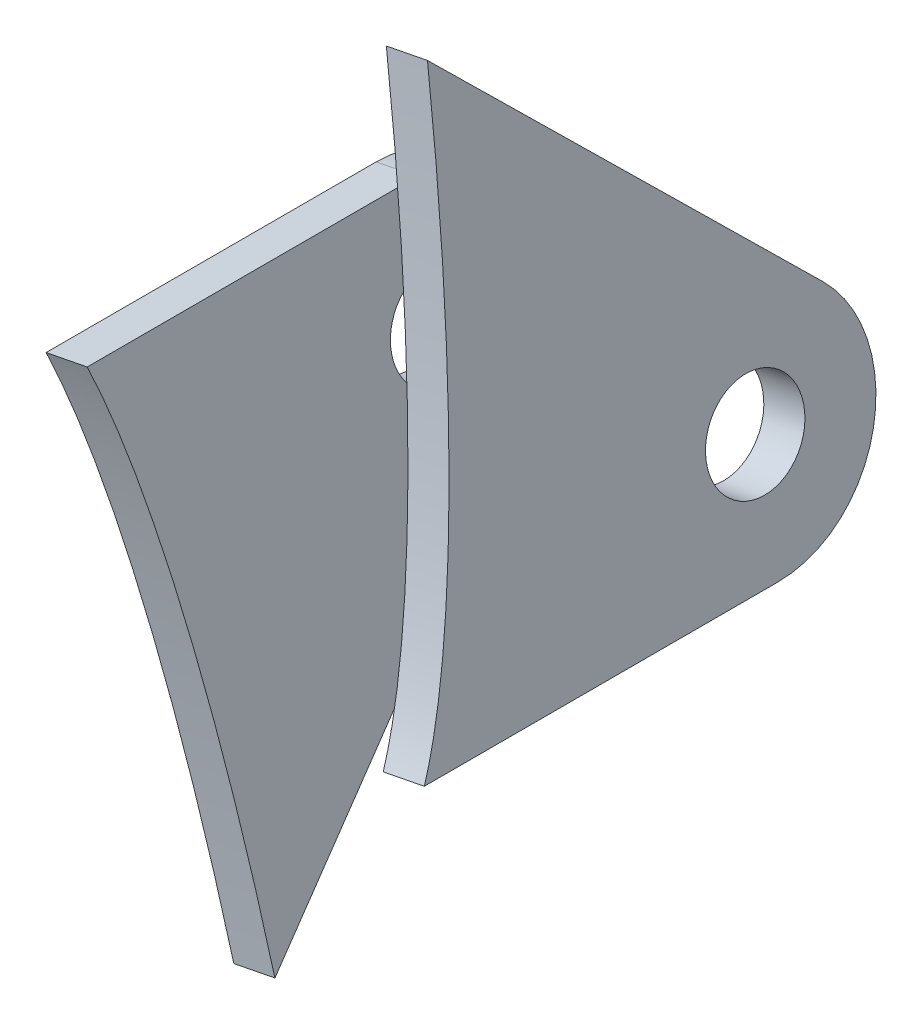
ISO-10303-21;
HEADER;
FILE_DESCRIPTION(('STEP AP214'),'2;1');
FILE_NAME('part.step','',(''),(''),'','','');
FILE_SCHEMA(('AUTOMOTIVE_DESIGN { 1 0 10303 214 1 1 1 1 }'));
ENDSEC;
DATA;
#1=APPLICATION_CONTEXT('core data for automotive mechanical design processes');
#2=APPLICATION_PROTOCOL_DEFINITION('international standard','automotive_design',2000,#1);
#3=PRODUCT_CONTEXT('',#1,'mechanical');
#4=PRODUCT('Part','Part','',(#3));
#5=PRODUCT_RELATED_PRODUCT_CATEGORY('part','',(#4));
#6=PRODUCT_DEFINITION_FORMATION('','',#4);
#7=PRODUCT_DEFINITION_CONTEXT('part definition',#1,'design');
#8=PRODUCT_DEFINITION('design','',#6,#7);
#9=PRODUCT_DEFINITION_SHAPE('','',#8);
#10=(LENGTH_UNIT() NAMED_UNIT(*) SI_UNIT(.MILLI.,.METRE.));
#11=(NAMED_UNIT(*) PLANE_ANGLE_UNIT() SI_UNIT($,.RADIAN.));
#12=(NAMED_UNIT(*) SI_UNIT($,.STERADIAN.) SOLID_ANGLE_UNIT());
#13=UNCERTAINTY_MEASURE_WITH_UNIT(LENGTH_MEASURE(1.E-05),#10,'distance_accuracy_value','');
#14=(GEOMETRIC_REPRESENTATION_CONTEXT(3) GLOBAL_UNCERTAINTY_ASSIGNED_CONTEXT((#13)) GLOBAL_UNIT_ASSIGNED_CONTEXT((#10,
#11,#12)) REPRESENTATION_CONTEXT('',''));
#15=CARTESIAN_POINT('',(0.,0.,0.));
#16=DIRECTION('',(0.,0.,1.));
#17=DIRECTION('',(1.,0.,0.));
#18=AXIS2_PLACEMENT_3D('',#15,#16,#17);
#19=CARTESIAN_POINT('',(1355.52524435521,308.134258911393,-42.2393244097412));
#20=DIRECTION('',(-0.136168267482673,0.693871930706592,-0.707106743503605));
#21=DIRECTION('',(0.,-0.713754853495984,-0.700395609003174));
#22=AXIS2_PLACEMENT_3D('',#19,#20,#21);
#23=PLANE('',#22);
#24=DIRECTION('',(-0.135715180098198,0.693960692822463,0.70710674350361));
#25=VECTOR('',#24,1.);
#26=CARTESIAN_POINT('',(1352.58120693435,307.557507053698,-42.2383449961358));
#27=LINE('',#26,#25);
#28=CARTESIAN_POINT('',(1429.01110735333,-83.256155859534,-440.45539007882));
#29=VERTEX_POINT('',#28);
#30=CARTESIAN_POINT('',(1424.44822645302,-59.9244991608975,-416.681749929812));
#31=VERTEX_POINT('',#30);
#32=EDGE_CURVE('E120',#29,#31,#27,.T.);
#33=ORIENTED_EDGE('',*,*,#32,.T.);
#34=DIRECTION('',(-0.9813458069517,-0.192250619231438,0.000326471201787507));
#35=VECTOR('',#34,1.);
#36=CARTESIAN_POINT('',(1427.39226387388,-59.3477473032032,-416.682729343418));
#37=LINE('',#36,#35);
#38=CARTESIAN_POINT('',(1427.39226387388,-59.3477473032032,-416.682729343418));
#39=VERTEX_POINT('',#38);
#40=EDGE_CURVE('E53',#39,#31,#37,.T.);
#41=ORIENTED_EDGE('',*,*,#40,.F.);
#42=DIRECTION('',(-0.135715180098198,0.693960692822463,0.70710674350361));
#43=VECTOR('',#42,1.);
#44=CARTESIAN_POINT('',(1355.52524435521,308.134258911393,-42.2393244097412));
#45=LINE('',#44,#43);
#46=CARTESIAN_POINT('',(1431.95514477419,-82.6794040018397,-440.456369492425));
#47=VERTEX_POINT('',#46);
#48=EDGE_CURVE('E103',#47,#39,#45,.T.);
#49=ORIENTED_EDGE('',*,*,#48,.F.);
#50=DIRECTION('',(-0.9813458069517,-0.192250619231438,0.000326471201787507));
#51=VECTOR('',#50,1.);
#52=CARTESIAN_POINT('',(1431.95514477419,-82.6794040018397,-440.456369492425));
#53=LINE('',#52,#51);
#54=EDGE_CURVE('E12',#47,#29,#53,.T.);
#55=ORIENTED_EDGE('',*,*,#54,.T.);
#56=EDGE_LOOP('',(#33,#41,#49,#55));
#57=FACE_BOUND('',#56,.T.);
#58=ADVANCED_FACE('F49',(#57),#23,.T.);
#59=CARTESIAN_POINT('',(1433.11257504779,-88.5773154128458,-434.445962172645));
#60=DIRECTION('',(-0.9813458069517,-0.192250619231438,0.000326471201787507));
#61=DIRECTION('',(0.192250629476805,-0.981345859249313,0.));
#62=AXIS2_PLACEMENT_3D('',#59,#60,#61);
#63=CYLINDRICAL_SURFACE('',#62,8.50000000000002);
#64=CARTESIAN_POINT('',(1430.16853762694,-89.1540672705402,-434.444982759039));
#65=DIRECTION('',(0.9813458069517,0.192250619231437,-0.00032647120177394));
#66=DIRECTION('',(0.192250629476805,-0.981345859249313,0.));
#67=AXIS2_PLACEMENT_3D('',#64,#65,#66);
#68=CIRCLE('',#67,8.50000000000002);
#69=CARTESIAN_POINT('',(1431.80266797749,-97.4955070741593,-434.444982759039));
#70=VERTEX_POINT('',#69);
#71=EDGE_CURVE('E91',#70,#29,#68,.T.);
#72=ORIENTED_EDGE('',*,*,#71,.T.);
#73=ORIENTED_EDGE('',*,*,#54,.F.);
#74=CARTESIAN_POINT('',(1433.11257504779,-88.5773154128458,-434.445962172645));
#75=DIRECTION('',(0.9813458069517,0.192250619231437,-0.00032647120177394));
#76=DIRECTION('',(0.192250629476805,-0.981345859249313,0.));
#77=AXIS2_PLACEMENT_3D('',#74,#75,#76);
#78=CIRCLE('',#77,8.50000000000002);
#79=CARTESIAN_POINT('',(1434.74670539834,-96.918755216465,-434.445962172645));
#80=VERTEX_POINT('',#79);
#81=EDGE_CURVE('E68',#80,#47,#78,.T.);
#82=ORIENTED_EDGE('',*,*,#81,.F.);
#83=DIRECTION('',(-0.9813458069517,-0.192250619231438,0.000326471201787507));
#84=VECTOR('',#83,1.);
#85=CARTESIAN_POINT('',(1434.74670539834,-96.918755216465,-434.445962172645));
#86=LINE('',#85,#84);
#87=EDGE_CURVE('E59',#80,#70,#86,.T.);
#88=ORIENTED_EDGE('',*,*,#87,.T.);
#89=EDGE_LOOP('',(#72,#73,#82,#88));
#90=FACE_BOUND('',#89,.T.);
#91=ADVANCED_FACE('F132',(#90),#63,.T.);
#92=CARTESIAN_POINT('',(1434.88574837375,-96.8915159926046,-0.453629060012102));
#93=DIRECTION('',(-0.192250629476805,0.981345859249313,0.));
#94=DIRECTION('',(-0.981345859249313,-0.192250629476805,0.));
#95=AXIS2_PLACEMENT_3D('',#92,#93,#94);
#96=PLANE('',#95);
#97=DIRECTION('',(0.000320381162025375,6.27642940451889E-05,0.999999946708276));
#98=VECTOR('',#97,1.);
#99=CARTESIAN_POINT('',(1431.94171095289,-97.4682678502989,-0.452649646406739));
#100=LINE('',#99,#98);
#101=CARTESIAN_POINT('',(1431.81079017439,-97.4939158946043,-409.093315948789));
#102=VERTEX_POINT('',#101);
#103=EDGE_CURVE('E85',#70,#102,#100,.T.);
#104=ORIENTED_EDGE('',*,*,#103,.F.);
#105=ORIENTED_EDGE('',*,*,#87,.F.);
#106=DIRECTION('',(0.000320381162025375,6.27642940451889E-05,0.999999946708276));
#107=VECTOR('',#106,1.);
#108=CARTESIAN_POINT('',(1434.88574837375,-96.8915159926046,-0.453629060012102));
#109=LINE('',#108,#107);
#110=CARTESIAN_POINT('',(1434.75482759525,-96.91716403691,-409.094295362394));
#111=VERTEX_POINT('',#110);
#112=EDGE_CURVE('E101',#80,#111,#109,.T.);
#113=ORIENTED_EDGE('',*,*,#112,.T.);
#114=DIRECTION('',(-0.9813458069517,-0.192250619231438,0.000326471201787507));
#115=VECTOR('',#114,1.);
#116=CARTESIAN_POINT('',(1434.75482759525,-96.91716403691,-409.094295362394));
#117=LINE('',#116,#115);
#118=EDGE_CURVE('E106',#111,#102,#117,.T.);
#119=ORIENTED_EDGE('',*,*,#118,.T.);
#120=EDGE_LOOP('',(#104,#105,#113,#119));
#121=FACE_BOUND('',#120,.T.);
#122=ADVANCED_FACE('F109',(#121),#96,.F.);
#123=CARTESIAN_POINT('',(1433.11257504779,-88.5773154128459,-434.445962172645));
#124=DIRECTION('',(-0.9813458069517,-0.192250619231438,0.000326471201787507));
#125=DIRECTION('',(0.192250629476805,-0.981345859249313,0.));
#126=AXIS2_PLACEMENT_3D('',#123,#124,#125);
#127=CYLINDRICAL_SURFACE('',#126,3.50000000000001);
#128=CARTESIAN_POINT('',(1433.11257504779,-88.5773154128459,-434.445962172645));
#129=DIRECTION('',(0.9813458069517,0.192250619231437,-0.00032647120177394));
#130=DIRECTION('',(0.192250629476805,-0.981345859249313,0.));
#131=AXIS2_PLACEMENT_3D('',#128,#129,#130);
#132=CIRCLE('',#131,3.50000000000001);
#133=CARTESIAN_POINT('',(1433.78545225096,-92.0120259202185,-434.445962172645));
#134=VERTEX_POINT('',#133);
#135=EDGE_CURVE('E130',#134,#134,#132,.T.);
#136=ORIENTED_EDGE('',*,*,#135,.T.);
#137=EDGE_LOOP('',(#136));
#138=FACE_BOUND('',#137,.T.);
#139=CARTESIAN_POINT('',(1430.16853762694,-89.1540672705402,-434.444982759039));
#140=DIRECTION('',(0.9813458069517,0.192250619231437,-0.00032647120177394));
#141=DIRECTION('',(0.192250629476805,-0.981345859249313,0.));
#142=AXIS2_PLACEMENT_3D('',#139,#140,#141);
#143=CIRCLE('',#142,3.50000000000001);
#144=CARTESIAN_POINT('',(1430.8414148301,-92.5887777779128,-434.444982759039));
#145=VERTEX_POINT('',#144);
#146=EDGE_CURVE('E117',#145,#145,#143,.T.);
#147=ORIENTED_EDGE('',*,*,#146,.F.);
#148=EDGE_LOOP('',(#147));
#149=FACE_BOUND('',#148,.T.);
#150=ADVANCED_FACE('F51',(#138,#149),#127,.F.);
#151=CARTESIAN_POINT('',(1410.44403811257,27.1845378212381,-404.996820951045));
#152=CARTESIAN_POINT('',(1410.43572118745,27.1845378212381,-429.996819567621));
#153=CARTESIAN_POINT('',(1435.43571980403,-100.428297078801,-430.00513649274));
#154=CARTESIAN_POINT('',(1435.44403672915,-100.428297078801,-405.005137876165));
#155=CARTESIAN_POINT('',(1435.45235365427,-100.428297078801,-380.00513925959));
#156=CARTESIAN_POINT('',(1410.45235503769,27.1845378212381,-379.99682233447));
#157=CARTESIAN_POINT('',(1410.44403811257,27.1845378212381,-404.996820951045));
#158=(BOUNDED_CURVE() B_SPLINE_CURVE(3,(#151,#152,#153,#154,#155,#156,#157),.UNSPECIFIED.,.T.,
.F.) B_SPLINE_CURVE_WITH_KNOTS((4,3,4),(0.,0.5,1.),
.UNSPECIFIED.) CURVE() GEOMETRIC_REPRESENTATION_ITEM() RATIONAL_B_SPLINE_CURVE((1.,
0.333333333333333,0.333333333333333,1.,0.333333333333333,0.333333333333333,1.)) REPRESENTATION_ITEM(''));
#159=DIRECTION('',(-0.9813458069517,-0.192250619231438,0.000326471201787507));
#160=VECTOR('',#159,1.);
#161=SURFACE_OF_LINEAR_EXTRUSION('',#158,#160);
#162=CARTESIAN_POINT('',(1407.50000069172,26.6077859635438,-404.99584153744));
#163=CARTESIAN_POINT('',(1407.4916837666,26.6077859635437,-429.995840154015));
#164=CARTESIAN_POINT('',(1432.49168238317,-101.005048936495,-430.004157079135));
#165=CARTESIAN_POINT('',(1432.49999930829,-101.005048936495,-405.00415846256));
#166=CARTESIAN_POINT('',(1432.50831623341,-101.005048936495,-380.004159845985));
#167=CARTESIAN_POINT('',(1407.50831761684,26.6077859635437,-379.995842920865));
#168=CARTESIAN_POINT('',(1407.50000069172,26.6077859635438,-404.99584153744));
#169=(BOUNDED_CURVE() B_SPLINE_CURVE(3,(#162,#163,#164,#165,#166,#167,#168),.UNSPECIFIED.,.T.,
.F.) B_SPLINE_CURVE_WITH_KNOTS((4,3,4),(0.,0.5,1.),
.UNSPECIFIED.) CURVE() GEOMETRIC_REPRESENTATION_ITEM() RATIONAL_B_SPLINE_CURVE((1.,
0.333333333333333,0.333333333333333,1.,0.333333333333333,0.333333333333333,1.)) REPRESENTATION_ITEM(''));
#170=EDGE_CURVE('E108',#31,#102,#169,.T.);
#171=ORIENTED_EDGE('',*,*,#170,.T.);
#172=ORIENTED_EDGE('',*,*,#118,.F.);
#173=EDGE_CURVE('E98',#39,#111,#158,.T.);
#174=ORIENTED_EDGE('',*,*,#173,.F.);
#175=ORIENTED_EDGE('',*,*,#40,.T.);
#176=EDGE_LOOP('',(#171,#172,#174,#175));
#177=FACE_BOUND('',#176,.T.);
#178=ADVANCED_FACE('F107',(#177),#161,.F.);
#179=CARTESIAN_POINT('',(1363.57195836778,267.130660268599,-0.453629060011384));
#180=DIRECTION('',(-0.9813458069517,-0.192250619231437,0.00032647120177394));
#181=DIRECTION('',(0.192250629476805,-0.981345859249313,0.));
#182=AXIS2_PLACEMENT_3D('',#179,#180,#181);
#183=PLANE('',#182);
#184=ORIENTED_EDGE('',*,*,#135,.F.);
#185=EDGE_LOOP('',(#184));
#186=FACE_BOUND('',#185,.T.);
#187=ORIENTED_EDGE('',*,*,#48,.T.);
#188=ORIENTED_EDGE('',*,*,#173,.T.);
#189=ORIENTED_EDGE('',*,*,#112,.F.);
#190=ORIENTED_EDGE('',*,*,#81,.T.);
#191=EDGE_LOOP('',(#187,#188,#189,#190));
#192=FACE_BOUND('',#191,.T.);
#193=ADVANCED_FACE('F99',(#186,#192),#183,.F.);
#194=CARTESIAN_POINT('',(1360.62792094692,266.553908410905,-0.452649646406021));
#195=DIRECTION('',(-0.9813458069517,-0.192250619231437,0.00032647120177394));
#196=DIRECTION('',(0.192250629476805,-0.981345859249313,0.));
#197=AXIS2_PLACEMENT_3D('',#194,#195,#196);
#198=PLANE('',#197);
#199=ORIENTED_EDGE('',*,*,#146,.T.);
#200=EDGE_LOOP('',(#199));
#201=FACE_BOUND('',#200,.T.);
#202=ORIENTED_EDGE('',*,*,#32,.F.);
#203=ORIENTED_EDGE('',*,*,#71,.F.);
#204=ORIENTED_EDGE('',*,*,#103,.T.);
#205=ORIENTED_EDGE('',*,*,#170,.F.);
#206=EDGE_LOOP('',(#202,#203,#204,#205));
#207=FACE_BOUND('',#206,.T.);
#208=ADVANCED_FACE('F135',(#201,#207),#198,.T.);
#209=CLOSED_SHELL('',(#58,#91,#122,#150,#178,#193,#208));
#210=MANIFOLD_SOLID_BREP('B2',#209);
#211=CARTESIAN_POINT('',(1415.64044683684,-134.580184633639,-404.672593211234));
#212=DIRECTION('',(0.135715180098194,-0.693960692822464,-0.70710674350361));
#213=DIRECTION('',(0.,-0.713710064520569,0.700441249357893));
#214=AXIS2_PLACEMENT_3D('',#211,#212,#213);
#215=PLANE('',#214);
#216=DIRECTION('',(0.136168267482668,-0.693871930706592,0.707106743503606));
#217=VECTOR('',#216,1.);
#218=CARTESIAN_POINT('',(1418.5844842577,-134.003432775944,-404.673572624839));
#219=LINE('',#218,#217);
#220=CARTESIAN_POINT('',(1411.69520051873,-98.8977455441605,-440.448860654784));
#221=VERTEX_POINT('',#220);
#222=CARTESIAN_POINT('',(1416.22677221443,-121.989251808875,-416.916910341118));
#223=VERTEX_POINT('',#222);
#224=EDGE_CURVE('E276',#221,#223,#219,.T.);
#225=ORIENTED_EDGE('',*,*,#224,.T.);
#226=DIRECTION('',(0.9813458069517,0.192250619231437,-0.000326471201780524));
#227=VECTOR('',#226,1.);
#228=CARTESIAN_POINT('',(1413.28273479358,-122.56600366657,-416.915930927512));
#229=LINE('',#228,#227);
#230=CARTESIAN_POINT('',(1413.28273479358,-122.56600366657,-416.915930927512));
#231=VERTEX_POINT('',#230);
#232=EDGE_CURVE('E209',#231,#223,#229,.T.);
#233=ORIENTED_EDGE('',*,*,#232,.F.);
#234=DIRECTION('',(0.136168267482668,-0.693871930706592,0.707106743503606));
#235=VECTOR('',#234,1.);
#236=CARTESIAN_POINT('',(1415.64044683684,-134.580184633639,-404.672593211234));
#237=LINE('',#236,#235);
#238=CARTESIAN_POINT('',(1408.75116309788,-99.4744974018548,-440.447881241179));
#239=VERTEX_POINT('',#238);
#240=EDGE_CURVE('E259',#239,#231,#237,.T.);
#241=ORIENTED_EDGE('',*,*,#240,.F.);
#242=DIRECTION('',(0.9813458069517,0.192250619231437,-0.000326471201780524));
#243=VECTOR('',#242,1.);
#244=CARTESIAN_POINT('',(1408.75116309788,-99.4744974018548,-440.447881241179));
#245=LINE('',#244,#243);
#246=EDGE_CURVE('E47',#239,#221,#245,.T.);
#247=ORIENTED_EDGE('',*,*,#246,.T.);
#248=EDGE_LOOP('',(#225,#233,#241,#247));
#249=FACE_BOUND('',#248,.T.);
#250=ADVANCED_FACE('F205',(#249),#215,.T.);
#251=CARTESIAN_POINT('',(1407.59758406704,-93.5758315128638,-434.437473921398));
#252=DIRECTION('',(0.9813458069517,0.192250619231437,-0.000326471201780524));
#253=DIRECTION('',(-0.192250629476805,0.981345859249313,0.));
#254=AXIS2_PLACEMENT_3D('',#251,#252,#253);
#255=CYLINDRICAL_SURFACE('',#254,8.50000000000007);
#256=CARTESIAN_POINT('',(1410.5416214879,-92.9990796551694,-434.438453335004));
#257=DIRECTION('',(-0.9813458069517,-0.192250619231437,0.000326471201780365));
#258=DIRECTION('',(-0.192250629476804,0.981345859249313,0.));
#259=AXIS2_PLACEMENT_3D('',#256,#257,#258);
#260=CIRCLE('',#259,8.50000000000007);
#261=CARTESIAN_POINT('',(1408.90749113735,-84.6576398515503,-434.438453335004));
#262=VERTEX_POINT('',#261);
#263=EDGE_CURVE('E247',#262,#221,#260,.T.);
#264=ORIENTED_EDGE('',*,*,#263,.T.);
#265=ORIENTED_EDGE('',*,*,#246,.F.);
#266=CARTESIAN_POINT('',(1407.59758406704,-93.5758315128638,-434.437473921398));
#267=DIRECTION('',(-0.9813458069517,-0.192250619231437,0.000326471201780365));
#268=DIRECTION('',(-0.192250629476804,0.981345859249313,0.));
#269=AXIS2_PLACEMENT_3D('',#266,#267,#268);
#270=CIRCLE('',#269,8.50000000000007);
#271=CARTESIAN_POINT('',(1405.96345371649,-85.2343917092446,-434.437473921398));
#272=VERTEX_POINT('',#271);
#273=EDGE_CURVE('E224',#272,#239,#270,.T.);
#274=ORIENTED_EDGE('',*,*,#273,.F.);
#275=DIRECTION('',(0.9813458069517,0.192250619231437,-0.000326471201780524));
#276=VECTOR('',#275,1.);
#277=CARTESIAN_POINT('',(1405.96345371649,-85.2343917092446,-434.437473921398));
#278=LINE('',#277,#276);
#279=EDGE_CURVE('E215',#272,#262,#278,.T.);
#280=ORIENTED_EDGE('',*,*,#279,.T.);
#281=EDGE_LOOP('',(#264,#265,#274,#280));
#282=FACE_BOUND('',#281,.T.);
#283=ADVANCED_FACE('F288',(#282),#255,.T.);
#284=CARTESIAN_POINT('',(1406.1024966919,-85.2071524853947,-0.445140808783872));
#285=DIRECTION('',(0.192250629476805,-0.981345859249313,0.));
#286=DIRECTION('',(0.981345859249313,0.192250629476805,0.));
#287=AXIS2_PLACEMENT_3D('',#284,#285,#286);
#288=PLANE('',#287);
#289=DIRECTION('',(0.000320381162036681,6.27642940208991E-05,0.999999946708276));
#290=VECTOR('',#289,1.);
#291=CARTESIAN_POINT('',(1409.04653411275,-84.6304006277004,-0.446120222389214));
#292=LINE('',#291,#290);
#293=CARTESIAN_POINT('',(1408.91507180398,-84.6561547605223,-410.777055209102));
#294=VERTEX_POINT('',#293);
#295=EDGE_CURVE('E241',#262,#294,#292,.T.);
#296=ORIENTED_EDGE('',*,*,#295,.F.);
#297=ORIENTED_EDGE('',*,*,#279,.F.);
#298=DIRECTION('',(0.000320381162036681,6.27642940208991E-05,0.999999946708276));
#299=VECTOR('',#298,1.);
#300=CARTESIAN_POINT('',(1406.1024966919,-85.2071524853947,-0.445140808783872));
#301=LINE('',#300,#299);
#302=CARTESIAN_POINT('',(1405.97103438312,-85.2329066182166,-410.776075795496));
#303=VERTEX_POINT('',#302);
#304=EDGE_CURVE('E257',#272,#303,#301,.T.);
#305=ORIENTED_EDGE('',*,*,#304,.T.);
#306=DIRECTION('',(0.9813458069517,0.192250619231437,-0.000326471201780524));
#307=VECTOR('',#306,1.);
#308=CARTESIAN_POINT('',(1405.97103438312,-85.2329066182166,-410.776075795496));
#309=LINE('',#308,#307);
#310=EDGE_CURVE('E262',#303,#294,#309,.T.);
#311=ORIENTED_EDGE('',*,*,#310,.T.);
#312=EDGE_LOOP('',(#296,#297,#305,#311));
#313=FACE_BOUND('',#312,.T.);
#314=ADVANCED_FACE('F265',(#313),#288,.F.);
#315=CARTESIAN_POINT('',(1407.59758406704,-93.5758315128638,-434.437473921398));
#316=DIRECTION('',(0.9813458069517,0.192250619231437,-0.000326471201780524));
#317=DIRECTION('',(-0.192250629476805,0.981345859249313,0.));
#318=AXIS2_PLACEMENT_3D('',#315,#316,#317);
#319=CYLINDRICAL_SURFACE('',#318,3.50000000000004);
#320=CARTESIAN_POINT('',(1407.59758406704,-93.5758315128638,-434.437473921398));
#321=DIRECTION('',(-0.9813458069517,-0.192250619231437,0.000326471201780365));
#322=DIRECTION('',(-0.192250629476804,0.981345859249313,0.));
#323=AXIS2_PLACEMENT_3D('',#320,#321,#322);
#324=CIRCLE('',#323,3.50000000000004);
#325=CARTESIAN_POINT('',(1406.92470686387,-90.1411210054912,-434.437473921398));
#326=VERTEX_POINT('',#325);
#327=EDGE_CURVE('E286',#326,#326,#324,.T.);
#328=CARTESIAN_POINT('',(1410.5416214879,-92.9990796551695,-434.438453335004));
#329=DIRECTION('',(-0.9813458069517,-0.192250619231437,0.000326471201780365));
#330=DIRECTION('',(-0.192250629476804,0.981345859249313,0.));
#331=AXIS2_PLACEMENT_3D('',#328,#329,#330);
#332=CIRCLE('',#331,3.50000000000004);
#333=CARTESIAN_POINT('',(1409.86874428473,-89.5643691477969,-434.438453335004));
#334=VERTEX_POINT('',#333);
#335=EDGE_CURVE('E273',#334,#334,#332,.T.);
#336=CARTESIAN_POINT('',(1406.92470686387,-90.1411210054912,-434.437473921398));
#337=CARTESIAN_POINT('',(1406.95537392034,-90.1351131736402,-434.437484123623));
#338=CARTESIAN_POINT('',(1406.98604097681,-90.1291053417892,-434.437494325848));
#339=CARTESIAN_POINT('',(1407.04737508974,-90.1170896780873,-434.437514730298));
#340=CARTESIAN_POINT('',(1407.07804214621,-90.1110818462363,-434.437524932523));
#341=CARTESIAN_POINT('',(1407.13937625915,-90.0990661825343,-434.437545336974));
#342=CARTESIAN_POINT('',(1407.17004331561,-90.0930583506833,-434.437555539199));
#343=CARTESIAN_POINT('',(1407.23137742855,-90.0810426869813,-434.437575943649));
#344=CARTESIAN_POINT('',(1407.26204448501,-90.0750348551304,-434.437586145874));
#345=CARTESIAN_POINT('',(1407.32337859795,-90.0630191914284,-434.437606550324));
#346=CARTESIAN_POINT('',(1407.35404565442,-90.0570113595774,-434.437616752549));
#347=CARTESIAN_POINT('',(1407.41537976735,-90.0449956958754,-434.437637156999));
#348=CARTESIAN_POINT('',(1407.44604682382,-90.0389878640245,-434.437647359224));
#349=CARTESIAN_POINT('',(1407.50738093675,-90.0269722003225,-434.437667763674));
#350=CARTESIAN_POINT('',(1407.53804799322,-90.0209643684715,-434.437677965899));
#351=CARTESIAN_POINT('',(1407.59938210615,-90.0089487047696,-434.437698370349));
#352=CARTESIAN_POINT('',(1407.63004916262,-90.0029408729186,-434.437708572574));
#353=CARTESIAN_POINT('',(1407.69138327556,-89.9909252092166,-434.437728977025));
#354=CARTESIAN_POINT('',(1407.72205033202,-89.9849173773656,-434.43773917925));
#355=CARTESIAN_POINT('',(1407.78338444496,-89.9729017136637,-434.4377595837));
#356=CARTESIAN_POINT('',(1407.81405150142,-89.9668938818127,-434.437769785925));
#357=CARTESIAN_POINT('',(1407.87538561436,-89.9548782181107,-434.437790190375));
#358=CARTESIAN_POINT('',(1407.90605267083,-89.9488703862597,-434.4378003926));
#359=CARTESIAN_POINT('',(1407.96738678376,-89.9368547225578,-434.43782079705));
#360=CARTESIAN_POINT('',(1407.99805384023,-89.9308468907068,-434.437830999275));
#361=CARTESIAN_POINT('',(1408.05938795316,-89.9188312270048,-434.437851403725));
#362=CARTESIAN_POINT('',(1408.09005500963,-89.9128233951538,-434.43786160595));
#363=CARTESIAN_POINT('',(1408.15138912256,-89.9008077314519,-434.4378820104));
#364=CARTESIAN_POINT('',(1408.18205617903,-89.8947998996009,-434.437892212625));
#365=CARTESIAN_POINT('',(1408.24339029197,-89.8827842358989,-434.437912617076));
#366=CARTESIAN_POINT('',(1408.27405734843,-89.8767764040479,-434.437922819301));
#367=CARTESIAN_POINT('',(1408.33539146137,-89.864760740346,-434.437943223751));
#368=CARTESIAN_POINT('',(1408.36605851783,-89.858752908495,-434.437953425976));
#369=CARTESIAN_POINT('',(1408.42739263077,-89.846737244793,-434.437973830426));
#370=CARTESIAN_POINT('',(1408.45805968724,-89.8407294129421,-434.437984032651));
#371=CARTESIAN_POINT('',(1408.51939380017,-89.8287137492401,-434.438004437101));
#372=CARTESIAN_POINT('',(1408.55006085664,-89.8227059173891,-434.438014639326));
#373=CARTESIAN_POINT('',(1408.61139496957,-89.8106902536871,-434.438035043776));
#374=CARTESIAN_POINT('',(1408.64206202604,-89.8046824218361,-434.438045246001));
#375=CARTESIAN_POINT('',(1408.70339613897,-89.7926667581342,-434.438065650451));
#376=CARTESIAN_POINT('',(1408.73406319544,-89.7866589262832,-434.438075852676));
#377=CARTESIAN_POINT('',(1408.79539730838,-89.7746432625813,-434.438096257127));
#378=CARTESIAN_POINT('',(1408.82606436484,-89.7686354307303,-434.438106459352));
#379=CARTESIAN_POINT('',(1408.88739847778,-89.7566197670283,-434.438126863802));
#380=CARTESIAN_POINT('',(1408.91806553425,-89.7506119351773,-434.438137066027));
#381=CARTESIAN_POINT('',(1408.97939964718,-89.7385962714753,-434.438157470477));
#382=CARTESIAN_POINT('',(1409.01006670365,-89.7325884396244,-434.438167672702));
#383=CARTESIAN_POINT('',(1409.07140081658,-89.7205727759224,-434.438188077152));
#384=CARTESIAN_POINT('',(1409.10206787305,-89.7145649440714,-434.438198279377));
#385=CARTESIAN_POINT('',(1409.16340198598,-89.7025492803694,-434.438218683827));
#386=CARTESIAN_POINT('',(1409.19406904245,-89.6965414485185,-434.438228886052));
#387=CARTESIAN_POINT('',(1409.25540315539,-89.6845257848165,-434.438249290502));
#388=CARTESIAN_POINT('',(1409.28607021185,-89.6785179529655,-434.438259492727));
#389=CARTESIAN_POINT('',(1409.34740432479,-89.6665022892636,-434.438279897178));
#390=CARTESIAN_POINT('',(1409.37807138125,-89.6604944574126,-434.438290099403));
#391=CARTESIAN_POINT('',(1409.43940549419,-89.6484787937106,-434.438310503853));
#392=CARTESIAN_POINT('',(1409.47007255066,-89.6424709618596,-434.438320706078));
#393=CARTESIAN_POINT('',(1409.53140666359,-89.6304552981577,-434.438341110528));
#394=CARTESIAN_POINT('',(1409.56207372006,-89.6244474663067,-434.438351312753));
#395=CARTESIAN_POINT('',(1409.62340783299,-89.6124318026047,-434.438371717203));
#396=CARTESIAN_POINT('',(1409.65407488946,-89.6064239707537,-434.438381919428));
#397=CARTESIAN_POINT('',(1409.71540900239,-89.5944083070518,-434.438402323878));
#398=CARTESIAN_POINT('',(1409.74607605886,-89.5884004752008,-434.438412526103));
#399=CARTESIAN_POINT('',(1409.8074101718,-89.5763848114988,-434.438432930553));
#400=CARTESIAN_POINT('',(1409.83807722826,-89.5703769796478,-434.438443132779));
#401=CARTESIAN_POINT('',(1409.86874428473,-89.5643691477969,-434.438453335004));
#402=B_SPLINE_CURVE_WITH_KNOTS('',3,(#336,#337,#338,#339,#340,#341,#342,#343,#344,#345,#346,
#347,#348,#349,#350,#351,#352,#353,#354,#355,#356,#357,#358,#359,#360,#361,#362,#363,#364,#365,
#366,#367,#368,#369,#370,#371,#372,#373,#374,#375,#376,#377,#378,#379,#380,#381,#382,#383,#384,
#385,#386,#387,#388,#389,#390,#391,#392,#393,#394,#395,#396,#397,#398,#399,#400,#401),
.UNSPECIFIED.,.F.,.F.,(4,2,2,2,2,2,2,2,2,2,2,2,2,2,2,2,2,2,2,2,2,2,2,2,2,2,2,2,2,2,2,2,4),(0.,
0.0937500000001655,0.187500000000113,0.281250000000061,0.375000000000224,0.468750000000171,
0.562500000000119,0.656250000000064,0.750000000000229,0.843750000000177,0.937500000000122,
1.03125000000007,1.12500000000023,1.21875000000018,1.31250000000013,1.40625000000008,
1.50000000000024,1.59375000000019,1.68750000000013,1.78125000000008,1.87500000000024,
1.96875000000019,2.06250000000014,2.15625000000008,2.25000000000003,2.3437500000002,
2.43750000000014,2.53125000000009,2.62500000000025,2.7187500000002,2.81250000000015,
2.90625000000009,3.00000000000026),.UNSPECIFIED.);
#403=EDGE_CURVE('BSEAM207',#326,#334,#402,.T.);
#404=ORIENTED_EDGE('',*,*,#327,.T.);
#405=ORIENTED_EDGE('',*,*,#335,.F.);
#406=ORIENTED_EDGE('',*,*,#403,.T.);
#407=ORIENTED_EDGE('',*,*,#403,.F.);
#408=EDGE_LOOP('',(#404,#406,#405,#407));
#409=FACE_BOUND('',#408,.T.);
#410=ADVANCED_FACE('F207',(#409),#319,.F.);
#411=CARTESIAN_POINT('',(1425.7167484133,-186.030658578238,-414.012387811522));
#412=CARTESIAN_POINT('',(1416.42904857337,-138.636627936667,-422.936775024015));
#413=CARTESIAN_POINT('',(1404.5750736221,-78.1193007199018,-417.897992106518));
#414=CARTESIAN_POINT('',(1404.55597631837,-77.9999453118086,-405.017553809317));
#415=CARTESIAN_POINT('',(1404.53687901463,-77.8805899037155,-392.137115512117));
#416=CARTESIAN_POINT('',(1416.37586028382,-138.304208758882,-387.063204008862));
#417=CARTESIAN_POINT('',(1425.68998288606,-185.863377873552,-395.960011053274));
#418=(BOUNDED_CURVE() B_SPLINE_CURVE(3,(#411,#412,#413,#414,#415,#416,#417),.UNSPECIFIED.,.F.,
.F.) B_SPLINE_CURVE_WITH_KNOTS((4,3,4),(0.,0.5,1.),
.UNSPECIFIED.) CURVE() GEOMETRIC_REPRESENTATION_ITEM() RATIONAL_B_SPLINE_CURVE((1.,
0.595040121757073,0.595040121757073,1.,0.595040121757073,0.595040121757073,1.)) REPRESENTATION_ITEM(''));
#419=DIRECTION('',(0.9813458069517,0.192250619231437,-0.000326471201780524));
#420=VECTOR('',#419,1.);
#421=SURFACE_OF_LINEAR_EXTRUSION('',#418,#420);
#422=CARTESIAN_POINT('',(1428.66078583415,-185.453906720544,-414.013367225127));
#423=CARTESIAN_POINT('',(1419.37308599423,-138.059876078973,-422.93775443762));
#424=CARTESIAN_POINT('',(1407.51911104296,-77.5425488622075,-417.898971520123));
#425=CARTESIAN_POINT('',(1407.50001373922,-77.4231934541143,-405.018533222923));
#426=CARTESIAN_POINT('',(1407.48091643549,-77.3038380460212,-392.138094925722));
#427=CARTESIAN_POINT('',(1419.31989770467,-137.727456901187,-387.064183422467));
#428=CARTESIAN_POINT('',(1428.63402030691,-185.286626015857,-395.960990466879));
#429=(BOUNDED_CURVE() B_SPLINE_CURVE(3,(#422,#423,#424,#425,#426,#427,#428),.UNSPECIFIED.,.F.,
.F.) B_SPLINE_CURVE_WITH_KNOTS((4,3,4),(0.,0.5,1.),
.UNSPECIFIED.) CURVE() GEOMETRIC_REPRESENTATION_ITEM() RATIONAL_B_SPLINE_CURVE((1.,
0.595040121757073,0.595040121757073,1.,0.595040121757073,0.595040121757073,1.)) REPRESENTATION_ITEM(''));
#430=EDGE_CURVE('E264',#223,#294,#429,.T.);
#431=ORIENTED_EDGE('',*,*,#430,.T.);
#432=ORIENTED_EDGE('',*,*,#310,.F.);
#433=EDGE_CURVE('E254',#231,#303,#418,.T.);
#434=ORIENTED_EDGE('',*,*,#433,.F.);
#435=ORIENTED_EDGE('',*,*,#232,.T.);
#436=EDGE_LOOP('',(#431,#432,#434,#435));
#437=FACE_BOUND('',#436,.T.);
#438=ADVANCED_FACE('F263',(#437),#421,.F.);
#439=CARTESIAN_POINT('',(1338.05696738703,262.132144168581,-0.445140808773981));
#440=DIRECTION('',(0.9813458069517,0.192250619231437,-0.000326471201780365));
#441=DIRECTION('',(-0.192250629476804,0.981345859249313,0.));
#442=AXIS2_PLACEMENT_3D('',#439,#440,#441);
#443=PLANE('',#442);
#444=ORIENTED_EDGE('',*,*,#327,.F.);
#445=EDGE_LOOP('',(#444));
#446=FACE_BOUND('',#445,.T.);
#447=ORIENTED_EDGE('',*,*,#240,.T.);
#448=ORIENTED_EDGE('',*,*,#433,.T.);
#449=ORIENTED_EDGE('',*,*,#304,.F.);
#450=ORIENTED_EDGE('',*,*,#273,.T.);
#451=EDGE_LOOP('',(#447,#448,#449,#450));
#452=FACE_BOUND('',#451,.T.);
#453=ADVANCED_FACE('F255',(#446,#452),#443,.F.);
#454=CARTESIAN_POINT('',(1341.00100480789,262.708896026275,-0.446120222379323));
#455=DIRECTION('',(0.9813458069517,0.192250619231437,-0.000326471201780365));
#456=DIRECTION('',(-0.192250629476804,0.981345859249313,0.));
#457=AXIS2_PLACEMENT_3D('',#454,#455,#456);
#458=PLANE('',#457);
#459=ORIENTED_EDGE('',*,*,#335,.T.);
#460=EDGE_LOOP('',(#459));
#461=FACE_BOUND('',#460,.T.);
#462=ORIENTED_EDGE('',*,*,#224,.F.);
#463=ORIENTED_EDGE('',*,*,#263,.F.);
#464=ORIENTED_EDGE('',*,*,#295,.T.);
#465=ORIENTED_EDGE('',*,*,#430,.F.);
#466=EDGE_LOOP('',(#462,#463,#464,#465));
#467=FACE_BOUND('',#466,.T.);
#468=ADVANCED_FACE('F291',(#461,#467),#458,.T.);
#469=CLOSED_SHELL('',(#250,#283,#314,#410,#438,#453,#468));
#470=MANIFOLD_SOLID_BREP('B6',#469);
#471=ADVANCED_BREP_SHAPE_REPRESENTATION('',(#18,#210,#470),#14);
#472=SHAPE_DEFINITION_REPRESENTATION(#9,#471);
ENDSEC;
END-ISO-10303-21;
